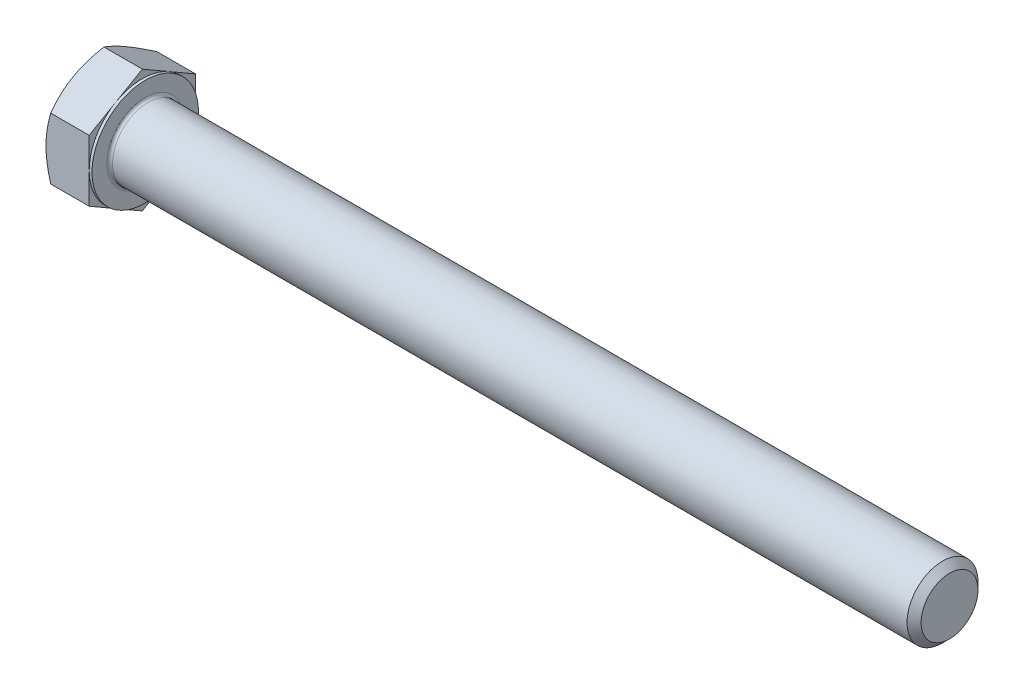
ISO-10303-21;
HEADER;
FILE_DESCRIPTION(('STEP AP214'),'2;1');
FILE_NAME('part.step','',(''),(''),'','','');
FILE_SCHEMA(('AUTOMOTIVE_DESIGN { 1 0 10303 214 1 1 1 1 }'));
ENDSEC;
DATA;
#1=APPLICATION_CONTEXT('core data for automotive mechanical design processes');
#2=APPLICATION_PROTOCOL_DEFINITION('international standard','automotive_design',2000,#1);
#3=PRODUCT_CONTEXT('',#1,'mechanical');
#4=PRODUCT('Part','Part','',(#3));
#5=PRODUCT_RELATED_PRODUCT_CATEGORY('part','',(#4));
#6=PRODUCT_DEFINITION_FORMATION('','',#4);
#7=PRODUCT_DEFINITION_CONTEXT('part definition',#1,'design');
#8=PRODUCT_DEFINITION('design','',#6,#7);
#9=PRODUCT_DEFINITION_SHAPE('','',#8);
#10=(LENGTH_UNIT() NAMED_UNIT(*) SI_UNIT(.MILLI.,.METRE.));
#11=(NAMED_UNIT(*) PLANE_ANGLE_UNIT() SI_UNIT($,.RADIAN.));
#12=(NAMED_UNIT(*) SI_UNIT($,.STERADIAN.) SOLID_ANGLE_UNIT());
#13=UNCERTAINTY_MEASURE_WITH_UNIT(LENGTH_MEASURE(1.E-05),#10,'distance_accuracy_value','');
#14=(GEOMETRIC_REPRESENTATION_CONTEXT(3) GLOBAL_UNCERTAINTY_ASSIGNED_CONTEXT((#13)) GLOBAL_UNIT_ASSIGNED_CONTEXT((#10,
#11,#12)) REPRESENTATION_CONTEXT('',''));
#15=CARTESIAN_POINT('',(0.,0.,0.));
#16=DIRECTION('',(0.,0.,1.));
#17=DIRECTION('',(1.,0.,0.));
#18=AXIS2_PLACEMENT_3D('',#15,#16,#17);
#19=CARTESIAN_POINT('',(0.,8.24155962262808,0.));
#20=DIRECTION('',(1.,0.,0.));
#21=DIRECTION('',(0.,0.,-1.));
#22=AXIS2_PLACEMENT_3D('',#19,#20,#21);
#23=PLANE('',#22);
#24=CARTESIAN_POINT('',(0.,0.,0.));
#25=DIRECTION('',(1.,0.,0.));
#26=DIRECTION('',(0.,0.,-1.));
#27=AXIS2_PLACEMENT_3D('',#24,#25,#26);
#28=CIRCLE('',#27,7.1374);
#29=CARTESIAN_POINT('',(0.,-6.18116971697105,-3.56870000000001));
#30=VERTEX_POINT('',#29);
#31=CARTESIAN_POINT('',(0.,0.,-7.1374));
#32=VERTEX_POINT('',#31);
#33=EDGE_CURVE('E114',#30,#32,#28,.T.);
#34=ORIENTED_EDGE('',*,*,#33,.F.);
#35=CARTESIAN_POINT('',(0.,0.,0.));
#36=DIRECTION('',(1.,0.,0.));
#37=DIRECTION('',(0.,0.,-1.));
#38=AXIS2_PLACEMENT_3D('',#35,#36,#37);
#39=CIRCLE('',#38,7.1374);
#40=CARTESIAN_POINT('',(0.,-6.18116971697106,3.56870000000001));
#41=VERTEX_POINT('',#40);
#42=EDGE_CURVE('E111',#41,#30,#39,.T.);
#43=ORIENTED_EDGE('',*,*,#42,.F.);
#44=CARTESIAN_POINT('',(0.,0.,0.));
#45=DIRECTION('',(1.,0.,0.));
#46=DIRECTION('',(0.,0.,-1.));
#47=AXIS2_PLACEMENT_3D('',#44,#45,#46);
#48=CIRCLE('',#47,7.1374);
#49=CARTESIAN_POINT('',(0.,0.,7.1374));
#50=VERTEX_POINT('',#49);
#51=EDGE_CURVE('E462',#50,#41,#48,.T.);
#52=ORIENTED_EDGE('',*,*,#51,.F.);
#53=CARTESIAN_POINT('',(0.,0.,0.));
#54=DIRECTION('',(1.,0.,0.));
#55=DIRECTION('',(0.,0.,-1.));
#56=AXIS2_PLACEMENT_3D('',#53,#54,#55);
#57=CIRCLE('',#56,7.1374);
#58=CARTESIAN_POINT('',(0.,6.18116971697105,3.56870000000001));
#59=VERTEX_POINT('',#58);
#60=EDGE_CURVE('E172',#59,#50,#57,.T.);
#61=ORIENTED_EDGE('',*,*,#60,.F.);
#62=CARTESIAN_POINT('',(0.,0.,0.));
#63=DIRECTION('',(1.,0.,0.));
#64=DIRECTION('',(0.,0.,-1.));
#65=AXIS2_PLACEMENT_3D('',#62,#63,#64);
#66=CIRCLE('',#65,7.1374);
#67=CARTESIAN_POINT('',(0.,6.18116971697105,-3.56870000000001));
#68=VERTEX_POINT('',#67);
#69=EDGE_CURVE('E460',#68,#59,#66,.T.);
#70=ORIENTED_EDGE('',*,*,#69,.F.);
#71=CARTESIAN_POINT('',(0.,0.,0.));
#72=DIRECTION('',(1.,0.,0.));
#73=DIRECTION('',(0.,0.,-1.));
#74=AXIS2_PLACEMENT_3D('',#71,#72,#73);
#75=CIRCLE('',#74,7.1374);
#76=EDGE_CURVE('E117',#32,#68,#75,.T.);
#77=ORIENTED_EDGE('',*,*,#76,.F.);
#78=EDGE_LOOP('',(#34,#43,#52,#61,#70,#77));
#79=FACE_BOUND('',#78,.T.);
#80=ADVANCED_FACE('F17',(#79),#23,.F.);
#81=CARTESIAN_POINT('',(0.641311776484754,0.,0.));
#82=DIRECTION('',(1.,0.,0.));
#83=DIRECTION('',(0.,0.,-1.));
#84=AXIS2_PLACEMENT_3D('',#81,#82,#83);
#85=CONICAL_SURFACE('',#84,8.24818458036387,1.0471975511966);
#86=ORIENTED_EDGE('',*,*,#42,.T.);
#87=CARTESIAN_POINT('',(0.,-6.18116971697106,-3.56870000000002));
#88=CARTESIAN_POINT('',(-2.91702878281906E-05,-6.26862170985652,-3.41722870509925));
#89=CARTESIAN_POINT('',(0.00371114889844038,-6.35606948988297,-3.26576470708432));
#90=CARTESIAN_POINT('',(0.0185139577467835,-6.53079334497843,-2.9631341127647));
#91=CARTESIAN_POINT('',(0.0295749978503088,-6.61806945060963,-2.81196746352471));
#92=CARTESIAN_POINT('',(0.0587296036169501,-6.7918862225359,-2.5109079833408));
#93=CARTESIAN_POINT('',(0.0767877659737066,-6.87842838481195,-2.3610125612818));
#94=CARTESIAN_POINT('',(0.119548178265526,-7.05110039256495,-2.06193587080869));
#95=CARTESIAN_POINT('',(0.144250603082628,-7.13723022712836,-1.91275462129736));
#96=CARTESIAN_POINT('',(0.227561148311189,-7.39464422393007,-1.46690050025742));
#97=CARTESIAN_POINT('',(0.295412992760169,-7.56518058886256,-1.17152285165624));
#98=CARTESIAN_POINT('',(0.451896700790797,-7.90478678087675,-0.583307672522674));
#99=CARTESIAN_POINT('',(0.540632343376944,-8.07384476218822,-0.290490659466179));
#100=CARTESIAN_POINT('',(0.637486855352638,-8.2415596226281,0.));
#101=B_SPLINE_CURVE_WITH_KNOTS('',3,(#87,#88,#89,#90,#91,#92,#93,#94,#95,#96,#97,#98,#99,#100),
.UNSPECIFIED.,.F.,.F.,(4,2,2,2,2,2,4),(0.,0.524658409500519,1.04921296370403,1.5711473776056,
2.09309553056225,3.13562382142666,4.18344647054619),.UNSPECIFIED.);
#102=CARTESIAN_POINT('',(0.637486855352637,-8.2415596226281,0.));
#103=VERTEX_POINT('',#102);
#104=EDGE_CURVE('E129',#30,#103,#101,.T.);
#105=ORIENTED_EDGE('',*,*,#104,.T.);
#106=CARTESIAN_POINT('',(0.637486855352637,-8.2415596226281,0.));
#107=CARTESIAN_POINT('',(0.540632343376944,-8.07384476218822,0.290490659466181));
#108=CARTESIAN_POINT('',(0.451896700790797,-7.90478678087675,0.583307672522676));
#109=CARTESIAN_POINT('',(0.295412992760169,-7.56518058886257,1.17152285165624));
#110=CARTESIAN_POINT('',(0.227561148311189,-7.39464422393008,1.46690050025742));
#111=CARTESIAN_POINT('',(0.14425060308263,-7.13723022712836,1.91275462129736));
#112=CARTESIAN_POINT('',(0.119548178265528,-7.05110039256495,2.06193587080869));
#113=CARTESIAN_POINT('',(0.0767877659737086,-6.87842838481196,2.3610125612818));
#114=CARTESIAN_POINT('',(0.0587296036169518,-6.7918862225359,2.5109079833408));
#115=CARTESIAN_POINT('',(0.0295749978503104,-6.61806945060963,2.81196746352471));
#116=CARTESIAN_POINT('',(0.0185139577467855,-6.53079334497843,2.9631341127647));
#117=CARTESIAN_POINT('',(0.00371114889844278,-6.35606948988298,3.26576470708432));
#118=CARTESIAN_POINT('',(-2.91702878256121E-05,-6.26862170985652,3.41722870509925));
#119=CARTESIAN_POINT('',(0.,-6.18116971697107,3.56870000000002));
#120=B_SPLINE_CURVE_WITH_KNOTS('',3,(#106,#107,#108,#109,#110,#111,#112,#113,#114,#115,#116,
#117,#118,#119),.UNSPECIFIED.,.F.,.F.,(4,2,2,2,2,2,4),(0.,1.04782264911953,2.09035093998394,
2.61229909294058,3.13423350684215,3.65878806104566,4.18344647054618),.UNSPECIFIED.);
#121=EDGE_CURVE('E135',#103,#41,#120,.T.);
#122=ORIENTED_EDGE('',*,*,#121,.T.);
#123=EDGE_LOOP('',(#86,#105,#122));
#124=FACE_BOUND('',#123,.T.);
#125=ADVANCED_FACE('F133',(#124),#85,.T.);
#126=CARTESIAN_POINT('',(0.641311776484743,0.,0.));
#127=DIRECTION('',(1.,0.,0.));
#128=DIRECTION('',(0.,0.,-1.));
#129=AXIS2_PLACEMENT_3D('',#126,#127,#128);
#130=CONICAL_SURFACE('',#129,8.24818458036385,1.0471975511966);
#131=ORIENTED_EDGE('',*,*,#33,.T.);
#132=CARTESIAN_POINT('',(0.,0.,-7.1374));
#133=CARTESIAN_POINT('',(-2.91702878363875E-05,-0.174903985770917,-7.1374));
#134=CARTESIAN_POINT('',(0.0037111488984321,-0.349799545823828,-7.1374));
#135=CARTESIAN_POINT('',(0.0185139577467752,-0.699247256014727,-7.1374));
#136=CARTESIAN_POINT('',(0.0295749978503004,-0.873799467277128,-7.1374));
#137=CARTESIAN_POINT('',(0.0587296036169417,-1.22143301112966,-7.1374));
#138=CARTESIAN_POINT('',(0.0767877659736981,-1.39451733568178,-7.1374));
#139=CARTESIAN_POINT('',(0.119548178265518,-1.73986135118776,-7.1374));
#140=CARTESIAN_POINT('',(0.144250603082619,-1.91212102031459,-7.1374));
#141=CARTESIAN_POINT('',(0.227561148311179,-2.42694901391801,-7.1374));
#142=CARTESIAN_POINT('',(0.295412992760159,-2.76802174378299,-7.1374));
#143=CARTESIAN_POINT('',(0.451896700790786,-3.44723412781136,-7.1374));
#144=CARTESIAN_POINT('',(0.540632343376933,-3.7853500904343,-7.1374));
#145=CARTESIAN_POINT('',(0.637486855352627,-4.12077981131404,-7.1374));
#146=B_SPLINE_CURVE_WITH_KNOTS('',3,(#132,#133,#134,#135,#136,#137,#138,#139,#140,#141,#142,
#143,#144,#145),.UNSPECIFIED.,.F.,.F.,(4,2,2,2,2,2,4),(0.,0.524658409500517,1.04921296370403,
1.5711473776056,2.09309553056224,3.13562382142665,4.18344647054617),.UNSPECIFIED.);
#147=CARTESIAN_POINT('',(0.637486855352626,-4.12077981131404,-7.1374));
#148=VERTEX_POINT('',#147);
#149=EDGE_CURVE('E125',#32,#148,#146,.T.);
#150=ORIENTED_EDGE('',*,*,#149,.T.);
#151=CARTESIAN_POINT('',(0.637486855352626,-4.12077981131404,-7.1374));
#152=CARTESIAN_POINT('',(0.540632343376933,-4.28849467175391,-6.84690934053382));
#153=CARTESIAN_POINT('',(0.451896700790788,-4.45755265306538,-6.55409232747733));
#154=CARTESIAN_POINT('',(0.295412992760162,-4.79715884507957,-5.96587714834377));
#155=CARTESIAN_POINT('',(0.227561148311183,-4.96769521001206,-5.6704994997426));
#156=CARTESIAN_POINT('',(0.144250603082625,-5.22510920681377,-5.22464537870266));
#157=CARTESIAN_POINT('',(0.119548178265524,-5.31123904137718,-5.07546412919133));
#158=CARTESIAN_POINT('',(0.076787765973705,-5.48391104913017,-4.77638743871822));
#159=CARTESIAN_POINT('',(0.0587296036169484,-5.57045321140623,-4.62649201665922));
#160=CARTESIAN_POINT('',(0.0295749978503076,-5.7442699833325,-4.32543253647532));
#161=CARTESIAN_POINT('',(0.0185139577467831,-5.8315460889637,-4.17426588723533));
#162=CARTESIAN_POINT('',(0.00371114889844091,-6.00626994405915,-3.87163529291571));
#163=CARTESIAN_POINT('',(-2.91702878274496E-05,-6.0937177240856,-3.72017129490078));
#164=CARTESIAN_POINT('',(0.,-6.18116971697106,-3.56870000000002));
#165=B_SPLINE_CURVE_WITH_KNOTS('',3,(#151,#152,#153,#154,#155,#156,#157,#158,#159,#160,#161,
#162,#163,#164),.UNSPECIFIED.,.F.,.F.,(4,2,2,2,2,2,4),(0.,1.04782264911952,2.09035093998392,
2.61229909294056,3.13423350684212,3.65878806104563,4.18344647054614),.UNSPECIFIED.);
#166=EDGE_CURVE('E123',#148,#30,#165,.T.);
#167=ORIENTED_EDGE('',*,*,#166,.T.);
#168=EDGE_LOOP('',(#131,#150,#167));
#169=FACE_BOUND('',#168,.T.);
#170=ADVANCED_FACE('F124',(#169),#130,.T.);
#171=CARTESIAN_POINT('',(0.641311776484739,0.,0.));
#172=DIRECTION('',(1.,0.,0.));
#173=DIRECTION('',(0.,0.,-1.));
#174=AXIS2_PLACEMENT_3D('',#171,#172,#173);
#175=CONICAL_SURFACE('',#174,8.24818458036384,1.0471975511966);
#176=CARTESIAN_POINT('',(0.637486855352624,4.12077981131404,-7.1374));
#177=CARTESIAN_POINT('',(0.540632343376931,3.78535009043429,-7.1374));
#178=CARTESIAN_POINT('',(0.451896700790785,3.44723412781136,-7.1374));
#179=CARTESIAN_POINT('',(0.295412992760157,2.76802174378299,-7.1374));
#180=CARTESIAN_POINT('',(0.227561148311177,2.42694901391801,-7.1374));
#181=CARTESIAN_POINT('',(0.144250603082619,1.91212102031458,-7.1374));
#182=CARTESIAN_POINT('',(0.119548178265517,1.73986135118776,-7.1374));
#183=CARTESIAN_POINT('',(0.076787765973698,1.39451733568178,-7.1374));
#184=CARTESIAN_POINT('',(0.0587296036169412,1.22143301112966,-7.1374));
#185=CARTESIAN_POINT('',(0.0295749978502998,0.873799467277126,-7.1374));
#186=CARTESIAN_POINT('',(0.018513957746775,0.699247256014726,-7.1374));
#187=CARTESIAN_POINT('',(0.0037111488984325,0.349799545823827,-7.1374));
#188=CARTESIAN_POINT('',(-2.91702878357943E-05,0.174903985770916,-7.1374));
#189=CARTESIAN_POINT('',(0.,0.,-7.1374));
#190=B_SPLINE_CURVE_WITH_KNOTS('',3,(#176,#177,#178,#179,#180,#181,#182,#183,#184,#185,#186,
#187,#188,#189),.UNSPECIFIED.,.F.,.F.,(4,2,2,2,2,2,4),(0.,1.04782264911952,2.09035093998393,
2.61229909294057,3.13423350684214,3.65878806104565,4.18344647054616),.UNSPECIFIED.);
#191=CARTESIAN_POINT('',(0.637486855352624,4.12077981131404,-7.1374));
#192=VERTEX_POINT('',#191);
#193=EDGE_CURVE('E143',#192,#32,#190,.T.);
#194=ORIENTED_EDGE('',*,*,#193,.T.);
#195=ORIENTED_EDGE('',*,*,#76,.T.);
#196=CARTESIAN_POINT('',(0.,6.18116971697105,-3.56870000000001));
#197=CARTESIAN_POINT('',(-2.9170287832926E-05,6.0937177240856,-3.72017129490077));
#198=CARTESIAN_POINT('',(0.00371114889843545,6.00626994405914,-3.8716352929157));
#199=CARTESIAN_POINT('',(0.018513957746778,5.83154608896369,-4.17426588723532));
#200=CARTESIAN_POINT('',(0.0295749978503029,5.74426998333249,-4.32543253647531));
#201=CARTESIAN_POINT('',(0.0587296036169437,5.57045321140622,-4.62649201665922));
#202=CARTESIAN_POINT('',(0.0767877659737001,5.48391104913017,-4.77638743871822));
#203=CARTESIAN_POINT('',(0.119548178265519,5.31123904137718,-5.07546412919132));
#204=CARTESIAN_POINT('',(0.144250603082621,5.22510920681376,-5.22464537870265));
#205=CARTESIAN_POINT('',(0.22756114831118,4.96769521001205,-5.67049949974259));
#206=CARTESIAN_POINT('',(0.295412992760159,4.79715884507956,-5.96587714834377));
#207=CARTESIAN_POINT('',(0.451896700790785,4.45755265306538,-6.55409232747733));
#208=CARTESIAN_POINT('',(0.540632343376931,4.28849467175391,-6.84690934053382));
#209=CARTESIAN_POINT('',(0.637486855352624,4.12077981131404,-7.1374));
#210=B_SPLINE_CURVE_WITH_KNOTS('',3,(#196,#197,#198,#199,#200,#201,#202,#203,#204,#205,#206,
#207,#208,#209),.UNSPECIFIED.,.F.,.F.,(4,2,2,2,2,2,4),(0.,0.524658409500515,1.04921296370402,
1.57114737760559,2.09309553056223,3.13562382142663,4.18344647054615),.UNSPECIFIED.);
#211=EDGE_CURVE('E249',#68,#192,#210,.T.);
#212=ORIENTED_EDGE('',*,*,#211,.T.);
#213=EDGE_LOOP('',(#194,#195,#212));
#214=FACE_BOUND('',#213,.T.);
#215=ADVANCED_FACE('F239',(#214),#175,.T.);
#216=CARTESIAN_POINT('',(0.641311776484745,0.,0.));
#217=DIRECTION('',(1.,0.,0.));
#218=DIRECTION('',(0.,0.,-1.));
#219=AXIS2_PLACEMENT_3D('',#216,#217,#218);
#220=CONICAL_SURFACE('',#219,8.24818458036385,1.0471975511966);
#221=CARTESIAN_POINT('',(0.637486855352629,8.24155962262808,0.));
#222=CARTESIAN_POINT('',(0.540632343376936,8.07384476218821,-0.290490659466181));
#223=CARTESIAN_POINT('',(0.45189670079079,7.90478678087674,-0.583307672522675));
#224=CARTESIAN_POINT('',(0.295412992760162,7.56518058886255,-1.17152285165624));
#225=CARTESIAN_POINT('',(0.227561148311182,7.39464422393006,-1.46690050025742));
#226=CARTESIAN_POINT('',(0.144250603082622,7.13723022712835,-1.91275462129736));
#227=CARTESIAN_POINT('',(0.119548178265521,7.05110039256494,-2.06193587080869));
#228=CARTESIAN_POINT('',(0.076787765973701,6.87842838481194,-2.3610125612818));
#229=CARTESIAN_POINT('',(0.0587296036169442,6.79188622253589,-2.5109079833408));
#230=CARTESIAN_POINT('',(0.0295749978503029,6.61806945060962,-2.81196746352471));
#231=CARTESIAN_POINT('',(0.018513957746778,6.53079334497842,-2.96313411276469));
#232=CARTESIAN_POINT('',(0.00371114889843529,6.35606948988297,-3.26576470708432));
#233=CARTESIAN_POINT('',(-2.91702878331806E-05,6.26862170985651,-3.41722870509924));
#234=CARTESIAN_POINT('',(0.,6.18116971697105,-3.56870000000001));
#235=B_SPLINE_CURVE_WITH_KNOTS('',3,(#221,#222,#223,#224,#225,#226,#227,#228,#229,#230,#231,
#232,#233,#234),.UNSPECIFIED.,.F.,.F.,(4,2,2,2,2,2,4),(0.,1.04782264911952,2.09035093998393,
2.61229909294058,3.13423350684215,3.65878806104566,4.18344647054617),.UNSPECIFIED.);
#236=CARTESIAN_POINT('',(0.637486855352629,8.24155962262808,0.));
#237=VERTEX_POINT('',#236);
#238=EDGE_CURVE('E244',#237,#68,#235,.T.);
#239=ORIENTED_EDGE('',*,*,#238,.T.);
#240=ORIENTED_EDGE('',*,*,#69,.T.);
#241=CARTESIAN_POINT('',(0.,6.18116971697105,3.56870000000001));
#242=CARTESIAN_POINT('',(-2.9170287834756E-05,6.26862170985651,3.41722870509925));
#243=CARTESIAN_POINT('',(0.00371114889843365,6.35606948988296,3.26576470708432));
#244=CARTESIAN_POINT('',(0.018513957746776,6.53079334497841,2.9631341127647));
#245=CARTESIAN_POINT('',(0.0295749978503007,6.61806945060961,2.81196746352471));
#246=CARTESIAN_POINT('',(0.0587296036169419,6.79188622253588,2.5109079833408));
#247=CARTESIAN_POINT('',(0.0767877659736988,6.87842838481194,2.3610125612818));
#248=CARTESIAN_POINT('',(0.119548178265519,7.05110039256493,2.06193587080869));
#249=CARTESIAN_POINT('',(0.14425060308262,7.13723022712835,1.91275462129736));
#250=CARTESIAN_POINT('',(0.22756114831118,7.39464422393006,1.46690050025742));
#251=CARTESIAN_POINT('',(0.295412992760161,7.56518058886255,1.17152285165624));
#252=CARTESIAN_POINT('',(0.451896700790789,7.90478678087674,0.583307672522675));
#253=CARTESIAN_POINT('',(0.540632343376935,8.07384476218821,0.29049065946618));
#254=CARTESIAN_POINT('',(0.637486855352629,8.24155962262808,0.));
#255=B_SPLINE_CURVE_WITH_KNOTS('',3,(#241,#242,#243,#244,#245,#246,#247,#248,#249,#250,#251,
#252,#253,#254),.UNSPECIFIED.,.F.,.F.,(4,2,2,2,2,2,4),(0.,0.524658409500518,1.04921296370403,
1.5711473776056,2.09309553056224,3.13562382142665,4.18344647054618),.UNSPECIFIED.);
#256=EDGE_CURVE('E231',#59,#237,#255,.T.);
#257=ORIENTED_EDGE('',*,*,#256,.T.);
#258=EDGE_LOOP('',(#239,#240,#257));
#259=FACE_BOUND('',#258,.T.);
#260=ADVANCED_FACE('F236',(#259),#220,.T.);
#261=CARTESIAN_POINT('',(0.641311776484745,0.,0.));
#262=DIRECTION('',(1.,0.,0.));
#263=DIRECTION('',(0.,0.,-1.));
#264=AXIS2_PLACEMENT_3D('',#261,#262,#263);
#265=CONICAL_SURFACE('',#264,8.24818458036385,1.0471975511966);
#266=ORIENTED_EDGE('',*,*,#51,.T.);
#267=CARTESIAN_POINT('',(0.,-6.18116971697107,3.56870000000002));
#268=CARTESIAN_POINT('',(-2.9170287825595E-05,-6.09371772408561,3.72017129490078));
#269=CARTESIAN_POINT('',(0.00371114889844298,-6.00626994405915,3.87163529291571));
#270=CARTESIAN_POINT('',(0.0185139577467859,-5.8315460889637,4.17426588723533));
#271=CARTESIAN_POINT('',(0.0295749978503109,-5.7442699833325,4.32543253647531));
#272=CARTESIAN_POINT('',(0.0587296036169516,-5.57045321140624,4.62649201665922));
#273=CARTESIAN_POINT('',(0.0767877659737078,-5.48391104913018,4.77638743871822));
#274=CARTESIAN_POINT('',(0.119548178265527,-5.31123904137719,5.07546412919133));
#275=CARTESIAN_POINT('',(0.144250603082628,-5.22510920681378,5.22464537870266));
#276=CARTESIAN_POINT('',(0.227561148311187,-4.96769521001206,5.6704994997426));
#277=CARTESIAN_POINT('',(0.295412992760166,-4.79715884507958,5.96587714834377));
#278=CARTESIAN_POINT('',(0.451896700790791,-4.45755265306539,6.55409232747733));
#279=CARTESIAN_POINT('',(0.540632343376936,-4.28849467175392,6.84690934053382));
#280=CARTESIAN_POINT('',(0.637486855352629,-4.12077981131405,7.1374));
#281=B_SPLINE_CURVE_WITH_KNOTS('',3,(#267,#268,#269,#270,#271,#272,#273,#274,#275,#276,#277,
#278,#279,#280),.UNSPECIFIED.,.F.,.F.,(4,2,2,2,2,2,4),(0.,0.524658409500513,1.04921296370402,
1.57114737760559,2.09309553056223,3.13562382142663,4.18344647054615),.UNSPECIFIED.);
#282=CARTESIAN_POINT('',(0.637486855352629,-4.12077981131405,7.1374));
#283=VERTEX_POINT('',#282);
#284=EDGE_CURVE('E130',#41,#283,#281,.T.);
#285=ORIENTED_EDGE('',*,*,#284,.T.);
#286=CARTESIAN_POINT('',(0.637486855352629,-4.12077981131405,7.1374));
#287=CARTESIAN_POINT('',(0.540632343376935,-3.78535009043431,7.1374));
#288=CARTESIAN_POINT('',(0.451896700790788,-3.44723412781137,7.1374));
#289=CARTESIAN_POINT('',(0.29541299276016,-2.768021743783,7.1374));
#290=CARTESIAN_POINT('',(0.22756114831118,-2.42694901391802,7.1374));
#291=CARTESIAN_POINT('',(0.14425060308262,-1.91212102031459,7.1374));
#292=CARTESIAN_POINT('',(0.119548178265519,-1.73986135118776,7.1374));
#293=CARTESIAN_POINT('',(0.0767877659736989,-1.39451733568178,7.1374));
#294=CARTESIAN_POINT('',(0.0587296036169421,-1.22143301112967,7.1374));
#295=CARTESIAN_POINT('',(0.0295749978503008,-0.87379946727713,7.1374));
#296=CARTESIAN_POINT('',(0.018513957746776,-0.699247256014728,7.1374));
#297=CARTESIAN_POINT('',(0.00371114889843334,-0.349799545823828,7.1374));
#298=CARTESIAN_POINT('',(-2.91702878350887E-05,-0.174903985770916,7.1374));
#299=CARTESIAN_POINT('',(0.,0.,7.1374));
#300=B_SPLINE_CURVE_WITH_KNOTS('',3,(#286,#287,#288,#289,#290,#291,#292,#293,#294,#295,#296,
#297,#298,#299),.UNSPECIFIED.,.F.,.F.,(4,2,2,2,2,2,4),(0.,1.04782264911953,2.09035093998394,
2.61229909294058,3.13423350684215,3.65878806104566,4.18344647054618),.UNSPECIFIED.);
#301=EDGE_CURVE('E209',#283,#50,#300,.T.);
#302=ORIENTED_EDGE('',*,*,#301,.T.);
#303=EDGE_LOOP('',(#266,#285,#302));
#304=FACE_BOUND('',#303,.T.);
#305=ADVANCED_FACE('F187',(#304),#265,.T.);
#306=CARTESIAN_POINT('',(0.641311776484738,0.,0.));
#307=DIRECTION('',(1.,0.,0.));
#308=DIRECTION('',(0.,0.,-1.));
#309=AXIS2_PLACEMENT_3D('',#306,#307,#308);
#310=CONICAL_SURFACE('',#309,8.24818458036384,1.0471975511966);
#311=CARTESIAN_POINT('',(0.637486855352622,4.12077981131403,7.1374));
#312=CARTESIAN_POINT('',(0.540632343376929,4.2884946717539,6.84690934053382));
#313=CARTESIAN_POINT('',(0.451896700790783,4.45755265306537,6.55409232747733));
#314=CARTESIAN_POINT('',(0.295412992760157,4.79715884507955,5.96587714834377));
#315=CARTESIAN_POINT('',(0.227561148311178,4.96769521001204,5.67049949974259));
#316=CARTESIAN_POINT('',(0.144250603082619,5.22510920681376,5.22464537870266));
#317=CARTESIAN_POINT('',(0.119548178265518,5.31123904137717,5.07546412919132));
#318=CARTESIAN_POINT('',(0.0767877659736985,5.48391104913016,4.77638743871822));
#319=CARTESIAN_POINT('',(0.0587296036169418,5.57045321140622,4.62649201665922));
#320=CARTESIAN_POINT('',(0.0295749978503007,5.74426998333248,4.32543253647531));
#321=CARTESIAN_POINT('',(0.0185139577467759,5.83154608896368,4.17426588723532));
#322=CARTESIAN_POINT('',(0.00371114889843337,6.00626994405913,3.8716352929157));
#323=CARTESIAN_POINT('',(-2.91702878350612E-05,6.09371772408559,3.72017129490078));
#324=CARTESIAN_POINT('',(0.,6.18116971697105,3.56870000000001));
#325=B_SPLINE_CURVE_WITH_KNOTS('',3,(#311,#312,#313,#314,#315,#316,#317,#318,#319,#320,#321,
#322,#323,#324),.UNSPECIFIED.,.F.,.F.,(4,2,2,2,2,2,4),(0.,1.04782264911952,2.09035093998392,
2.61229909294056,3.13423350684213,3.65878806104564,4.18344647054615),.UNSPECIFIED.);
#326=CARTESIAN_POINT('',(0.637486855352622,4.12077981131403,7.1374));
#327=VERTEX_POINT('',#326);
#328=EDGE_CURVE('E193',#327,#59,#325,.T.);
#329=ORIENTED_EDGE('',*,*,#328,.T.);
#330=ORIENTED_EDGE('',*,*,#60,.T.);
#331=CARTESIAN_POINT('',(0.,0.,7.1374));
#332=CARTESIAN_POINT('',(-2.91702878350349E-05,0.174903985770917,7.1374));
#333=CARTESIAN_POINT('',(0.00371114889843339,0.349799545823827,7.1374));
#334=CARTESIAN_POINT('',(0.0185139577467758,0.699247256014725,7.1374));
#335=CARTESIAN_POINT('',(0.0295749978503005,0.873799467277125,7.1374));
#336=CARTESIAN_POINT('',(0.0587296036169414,1.22143301112966,7.1374));
#337=CARTESIAN_POINT('',(0.076787765973698,1.39451733568177,7.1374));
#338=CARTESIAN_POINT('',(0.119548178265517,1.73986135118775,7.1374));
#339=CARTESIAN_POINT('',(0.144250603082619,1.91212102031458,7.1374));
#340=CARTESIAN_POINT('',(0.227561148311177,2.426949013918,7.1374));
#341=CARTESIAN_POINT('',(0.295412992760157,2.76802174378298,7.1374));
#342=CARTESIAN_POINT('',(0.451896700790783,3.44723412781135,7.1374));
#343=CARTESIAN_POINT('',(0.540632343376929,3.78535009043429,7.1374));
#344=CARTESIAN_POINT('',(0.637486855352622,4.12077981131403,7.1374));
#345=B_SPLINE_CURVE_WITH_KNOTS('',3,(#331,#332,#333,#334,#335,#336,#337,#338,#339,#340,#341,
#342,#343,#344),.UNSPECIFIED.,.F.,.F.,(4,2,2,2,2,2,4),(0.,0.524658409500515,1.04921296370402,
1.57114737760559,2.09309553056223,3.13562382142663,4.18344647054615),.UNSPECIFIED.);
#346=EDGE_CURVE('E201',#50,#327,#345,.T.);
#347=ORIENTED_EDGE('',*,*,#346,.T.);
#348=EDGE_LOOP('',(#329,#330,#347));
#349=FACE_BOUND('',#348,.T.);
#350=ADVANCED_FACE('F182',(#349),#310,.T.);
#351=CARTESIAN_POINT('',(6.1722,-8.2415596226281,0.));
#352=DIRECTION('',(0.,0.866025403784438,-0.500000000000001));
#353=DIRECTION('',(0.,0.500000000000001,0.866025403784438));
#354=AXIS2_PLACEMENT_3D('',#351,#352,#353);
#355=PLANE('',#354);
#356=DIRECTION('',(-1.,0.,0.));
#357=VECTOR('',#356,1.);
#358=CARTESIAN_POINT('',(6.1722,-4.12077981131405,7.1374));
#359=LINE('',#358,#357);
#360=CARTESIAN_POINT('',(5.7912,-4.12077981131405,7.1374));
#361=VERTEX_POINT('',#360);
#362=EDGE_CURVE('E386',#361,#283,#359,.T.);
#363=ORIENTED_EDGE('',*,*,#362,.T.);
#364=ORIENTED_EDGE('',*,*,#284,.F.);
#365=ORIENTED_EDGE('',*,*,#121,.F.);
#366=DIRECTION('',(1.,0.,0.));
#367=VECTOR('',#366,1.);
#368=CARTESIAN_POINT('',(6.1722,-8.2415596226281,0.));
#369=LINE('',#368,#367);
#370=CARTESIAN_POINT('',(5.7912,-8.2415596226281,0.));
#371=VERTEX_POINT('',#370);
#372=EDGE_CURVE('E141',#103,#371,#369,.T.);
#373=ORIENTED_EDGE('',*,*,#372,.T.);
#374=DIRECTION('',(0.,-0.500000000000005,-0.866025403784436));
#375=VECTOR('',#374,1.);
#376=CARTESIAN_POINT('',(5.7912,-6.18116971697105,3.5687));
#377=LINE('',#376,#375);
#378=CARTESIAN_POINT('',(5.7912,-6.18116971697105,3.5687));
#379=VERTEX_POINT('',#378);
#380=EDGE_CURVE('E366',#379,#371,#377,.T.);
#381=ORIENTED_EDGE('',*,*,#380,.F.);
#382=DIRECTION('',(0.,-0.499999999999996,-0.866025403784441));
#383=VECTOR('',#382,1.);
#384=CARTESIAN_POINT('',(5.7912,-4.12077981131405,7.1374));
#385=LINE('',#384,#383);
#386=EDGE_CURVE('E371',#361,#379,#385,.T.);
#387=ORIENTED_EDGE('',*,*,#386,.F.);
#388=EDGE_LOOP('',(#363,#364,#365,#373,#381,#387));
#389=FACE_BOUND('',#388,.T.);
#390=ADVANCED_FACE('F178',(#389),#355,.F.);
#391=CARTESIAN_POINT('',(6.1722,-4.12077981131404,-7.1374));
#392=DIRECTION('',(0.,0.866025403784438,0.500000000000001));
#393=DIRECTION('',(0.,-0.500000000000001,0.866025403784438));
#394=AXIS2_PLACEMENT_3D('',#391,#392,#393);
#395=PLANE('',#394);
#396=ORIENTED_EDGE('',*,*,#372,.F.);
#397=ORIENTED_EDGE('',*,*,#104,.F.);
#398=ORIENTED_EDGE('',*,*,#166,.F.);
#399=DIRECTION('',(1.,0.,0.));
#400=VECTOR('',#399,1.);
#401=CARTESIAN_POINT('',(6.1722,-4.12077981131404,-7.1374));
#402=LINE('',#401,#400);
#403=CARTESIAN_POINT('',(5.7912,-4.12077981131404,-7.1374));
#404=VERTEX_POINT('',#403);
#405=EDGE_CURVE('E250',#148,#404,#402,.T.);
#406=ORIENTED_EDGE('',*,*,#405,.T.);
#407=DIRECTION('',(0.,0.499999999999998,-0.866025403784439));
#408=VECTOR('',#407,1.);
#409=CARTESIAN_POINT('',(5.7912,-6.18116971697105,-3.56870000000001));
#410=LINE('',#409,#408);
#411=CARTESIAN_POINT('',(5.7912,-6.18116971697104,-3.56870000000001));
#412=VERTEX_POINT('',#411);
#413=EDGE_CURVE('E356',#412,#404,#410,.T.);
#414=ORIENTED_EDGE('',*,*,#413,.F.);
#415=DIRECTION('',(0.,0.500000000000005,-0.866025403784436));
#416=VECTOR('',#415,1.);
#417=CARTESIAN_POINT('',(5.7912,-8.2415596226281,0.));
#418=LINE('',#417,#416);
#419=EDGE_CURVE('E361',#371,#412,#418,.T.);
#420=ORIENTED_EDGE('',*,*,#419,.F.);
#421=EDGE_LOOP('',(#396,#397,#398,#406,#414,#420));
#422=FACE_BOUND('',#421,.T.);
#423=ADVANCED_FACE('F139',(#422),#395,.F.);
#424=CARTESIAN_POINT('',(6.1722,4.12077981131404,-7.1374));
#425=DIRECTION('',(0.,0.,1.));
#426=DIRECTION('',(0.,-1.,0.));
#427=AXIS2_PLACEMENT_3D('',#424,#425,#426);
#428=PLANE('',#427);
#429=ORIENTED_EDGE('',*,*,#405,.F.);
#430=ORIENTED_EDGE('',*,*,#149,.F.);
#431=ORIENTED_EDGE('',*,*,#193,.F.);
#432=DIRECTION('',(1.,0.,0.));
#433=VECTOR('',#432,1.);
#434=CARTESIAN_POINT('',(6.1722,4.12077981131404,-7.1374));
#435=LINE('',#434,#433);
#436=CARTESIAN_POINT('',(5.7912,4.12077981131404,-7.1374));
#437=VERTEX_POINT('',#436);
#438=EDGE_CURVE('E394',#192,#437,#435,.T.);
#439=ORIENTED_EDGE('',*,*,#438,.T.);
#440=DIRECTION('',(0.,1.,0.));
#441=VECTOR('',#440,1.);
#442=CARTESIAN_POINT('',(5.7912,7.1374,-7.1374));
#443=LINE('',#442,#441);
#444=CARTESIAN_POINT('',(5.7912,0.,-7.1374));
#445=VERTEX_POINT('',#444);
#446=EDGE_CURVE('E341',#445,#437,#443,.T.);
#447=ORIENTED_EDGE('',*,*,#446,.F.);
#448=DIRECTION('',(0.,1.,0.));
#449=VECTOR('',#448,1.);
#450=CARTESIAN_POINT('',(5.7912,7.1374,-7.1374));
#451=LINE('',#450,#449);
#452=EDGE_CURVE('E351',#404,#445,#451,.T.);
#453=ORIENTED_EDGE('',*,*,#452,.F.);
#454=EDGE_LOOP('',(#429,#430,#431,#439,#447,#453));
#455=FACE_BOUND('',#454,.T.);
#456=ADVANCED_FACE('F257',(#455),#428,.F.);
#457=CARTESIAN_POINT('',(6.1722,4.12077981131404,-7.1374));
#458=DIRECTION('',(0.,-0.866025403784438,0.500000000000001));
#459=DIRECTION('',(0.,-0.500000000000001,-0.866025403784438));
#460=AXIS2_PLACEMENT_3D('',#457,#458,#459);
#461=PLANE('',#460);
#462=ORIENTED_EDGE('',*,*,#438,.F.);
#463=ORIENTED_EDGE('',*,*,#211,.F.);
#464=ORIENTED_EDGE('',*,*,#238,.F.);
#465=DIRECTION('',(1.,0.,0.));
#466=VECTOR('',#465,1.);
#467=CARTESIAN_POINT('',(6.1722,8.24155962262808,0.));
#468=LINE('',#467,#466);
#469=CARTESIAN_POINT('',(5.7912,8.24155962262808,0.));
#470=VERTEX_POINT('',#469);
#471=EDGE_CURVE('E235',#237,#470,#468,.T.);
#472=ORIENTED_EDGE('',*,*,#471,.T.);
#473=DIRECTION('',(0.,0.500000000000002,0.866025403784437));
#474=VECTOR('',#473,1.);
#475=CARTESIAN_POINT('',(5.7912,6.18116971697105,-3.56870000000001));
#476=LINE('',#475,#474);
#477=CARTESIAN_POINT('',(5.7912,6.18116971697105,-3.5687));
#478=VERTEX_POINT('',#477);
#479=EDGE_CURVE('E336',#478,#470,#476,.T.);
#480=ORIENTED_EDGE('',*,*,#479,.F.);
#481=DIRECTION('',(0.,0.5,0.866025403784439));
#482=VECTOR('',#481,1.);
#483=CARTESIAN_POINT('',(5.7912,4.12077981131404,-7.1374));
#484=LINE('',#483,#482);
#485=EDGE_CURVE('E346',#437,#478,#484,.T.);
#486=ORIENTED_EDGE('',*,*,#485,.F.);
#487=EDGE_LOOP('',(#462,#463,#464,#472,#480,#486));
#488=FACE_BOUND('',#487,.T.);
#489=ADVANCED_FACE('F227',(#488),#461,.F.);
#490=CARTESIAN_POINT('',(6.1722,8.24155962262808,0.));
#491=DIRECTION('',(0.,-0.866025403784438,-0.500000000000001));
#492=DIRECTION('',(0.,0.500000000000001,-0.866025403784438));
#493=AXIS2_PLACEMENT_3D('',#490,#491,#492);
#494=PLANE('',#493);
#495=ORIENTED_EDGE('',*,*,#471,.F.);
#496=ORIENTED_EDGE('',*,*,#256,.F.);
#497=ORIENTED_EDGE('',*,*,#328,.F.);
#498=DIRECTION('',(-1.,0.,0.));
#499=VECTOR('',#498,1.);
#500=CARTESIAN_POINT('',(6.1722,4.12077981131403,7.1374));
#501=LINE('',#500,#499);
#502=CARTESIAN_POINT('',(5.7912,4.12077981131403,7.1374));
#503=VERTEX_POINT('',#502);
#504=EDGE_CURVE('E208',#327,#503,#501,.F.);
#505=ORIENTED_EDGE('',*,*,#504,.T.);
#506=DIRECTION('',(0.,-0.500000000000001,0.866025403784438));
#507=VECTOR('',#506,1.);
#508=CARTESIAN_POINT('',(5.7912,6.18116971697105,3.56870000000001));
#509=LINE('',#508,#507);
#510=CARTESIAN_POINT('',(5.7912,6.18116971697104,3.56870000000001));
#511=VERTEX_POINT('',#510);
#512=EDGE_CURVE('E326',#511,#503,#509,.T.);
#513=ORIENTED_EDGE('',*,*,#512,.F.);
#514=DIRECTION('',(0.,-0.500000000000002,0.866025403784438));
#515=VECTOR('',#514,1.);
#516=CARTESIAN_POINT('',(5.7912,8.24155962262808,0.));
#517=LINE('',#516,#515);
#518=EDGE_CURVE('E331',#470,#511,#517,.T.);
#519=ORIENTED_EDGE('',*,*,#518,.F.);
#520=EDGE_LOOP('',(#495,#496,#497,#505,#513,#519));
#521=FACE_BOUND('',#520,.T.);
#522=ADVANCED_FACE('F220',(#521),#494,.F.);
#523=CARTESIAN_POINT('',(6.1722,4.12077981131403,7.1374));
#524=DIRECTION('',(0.,0.,-1.));
#525=DIRECTION('',(-1.,0.,0.));
#526=AXIS2_PLACEMENT_3D('',#523,#524,#525);
#527=PLANE('',#526);
#528=ORIENTED_EDGE('',*,*,#504,.F.);
#529=ORIENTED_EDGE('',*,*,#346,.F.);
#530=ORIENTED_EDGE('',*,*,#301,.F.);
#531=ORIENTED_EDGE('',*,*,#362,.F.);
#532=DIRECTION('',(0.,1.,0.));
#533=VECTOR('',#532,1.);
#534=CARTESIAN_POINT('',(5.7912,7.1374,7.1374));
#535=LINE('',#534,#533);
#536=CARTESIAN_POINT('',(5.7912,0.,7.1374));
#537=VERTEX_POINT('',#536);
#538=EDGE_CURVE('E376',#537,#361,#535,.F.);
#539=ORIENTED_EDGE('',*,*,#538,.F.);
#540=DIRECTION('',(0.,1.,0.));
#541=VECTOR('',#540,1.);
#542=CARTESIAN_POINT('',(5.7912,7.1374,7.1374));
#543=LINE('',#542,#541);
#544=EDGE_CURVE('E318',#503,#537,#543,.F.);
#545=ORIENTED_EDGE('',*,*,#544,.F.);
#546=EDGE_LOOP('',(#528,#529,#530,#531,#539,#545));
#547=FACE_BOUND('',#546,.T.);
#548=ADVANCED_FACE('F215',(#547),#527,.F.);
#549=CARTESIAN_POINT('',(5.7912,7.1374,0.));
#550=DIRECTION('',(1.,0.,0.));
#551=DIRECTION('',(0.,0.,-1.));
#552=AXIS2_PLACEMENT_3D('',#549,#550,#551);
#553=PLANE('',#552);
#554=ORIENTED_EDGE('',*,*,#386,.T.);
#555=CARTESIAN_POINT('',(5.7912,0.,0.));
#556=DIRECTION('',(-1.,0.,0.));
#557=DIRECTION('',(0.,0.,1.));
#558=AXIS2_PLACEMENT_3D('',#555,#556,#557);
#559=CIRCLE('',#558,7.1374);
#560=EDGE_CURVE('E210',#537,#379,#559,.F.);
#561=ORIENTED_EDGE('',*,*,#560,.F.);
#562=ORIENTED_EDGE('',*,*,#538,.T.);
#563=EDGE_LOOP('',(#554,#561,#562));
#564=FACE_BOUND('',#563,.T.);
#565=ADVANCED_FACE('F219',(#564),#553,.T.);
#566=CARTESIAN_POINT('',(5.7912,7.1374,0.));
#567=DIRECTION('',(1.,0.,0.));
#568=DIRECTION('',(0.,0.,-1.));
#569=AXIS2_PLACEMENT_3D('',#566,#567,#568);
#570=PLANE('',#569);
#571=ORIENTED_EDGE('',*,*,#419,.T.);
#572=CARTESIAN_POINT('',(5.7912,0.,0.));
#573=DIRECTION('',(-1.,0.,0.));
#574=DIRECTION('',(0.,0.,1.));
#575=AXIS2_PLACEMENT_3D('',#572,#573,#574);
#576=CIRCLE('',#575,7.1374);
#577=EDGE_CURVE('E420',#379,#412,#576,.F.);
#578=ORIENTED_EDGE('',*,*,#577,.F.);
#579=ORIENTED_EDGE('',*,*,#380,.T.);
#580=EDGE_LOOP('',(#571,#578,#579));
#581=FACE_BOUND('',#580,.T.);
#582=ADVANCED_FACE('F440',(#581),#570,.T.);
#583=CARTESIAN_POINT('',(5.7912,7.1374,0.));
#584=DIRECTION('',(1.,0.,0.));
#585=DIRECTION('',(0.,0.,-1.));
#586=AXIS2_PLACEMENT_3D('',#583,#584,#585);
#587=PLANE('',#586);
#588=ORIENTED_EDGE('',*,*,#452,.T.);
#589=CARTESIAN_POINT('',(5.7912,0.,0.));
#590=DIRECTION('',(-1.,0.,0.));
#591=DIRECTION('',(0.,0.,1.));
#592=AXIS2_PLACEMENT_3D('',#589,#590,#591);
#593=CIRCLE('',#592,7.1374);
#594=EDGE_CURVE('E418',#412,#445,#593,.F.);
#595=ORIENTED_EDGE('',*,*,#594,.F.);
#596=ORIENTED_EDGE('',*,*,#413,.T.);
#597=EDGE_LOOP('',(#588,#595,#596));
#598=FACE_BOUND('',#597,.T.);
#599=ADVANCED_FACE('F443',(#598),#587,.T.);
#600=CARTESIAN_POINT('',(5.7912,7.1374,0.));
#601=DIRECTION('',(1.,0.,0.));
#602=DIRECTION('',(0.,0.,-1.));
#603=AXIS2_PLACEMENT_3D('',#600,#601,#602);
#604=PLANE('',#603);
#605=CARTESIAN_POINT('',(5.7912,0.,0.));
#606=DIRECTION('',(-1.,0.,0.));
#607=DIRECTION('',(0.,0.,1.));
#608=AXIS2_PLACEMENT_3D('',#605,#606,#607);
#609=CIRCLE('',#608,7.1374);
#610=EDGE_CURVE('E415',#445,#478,#609,.F.);
#611=ORIENTED_EDGE('',*,*,#610,.F.);
#612=ORIENTED_EDGE('',*,*,#446,.T.);
#613=ORIENTED_EDGE('',*,*,#485,.T.);
#614=EDGE_LOOP('',(#611,#612,#613));
#615=FACE_BOUND('',#614,.T.);
#616=ADVANCED_FACE('F447',(#615),#604,.T.);
#617=CARTESIAN_POINT('',(5.7912,7.1374,0.));
#618=DIRECTION('',(1.,0.,0.));
#619=DIRECTION('',(0.,0.,-1.));
#620=AXIS2_PLACEMENT_3D('',#617,#618,#619);
#621=PLANE('',#620);
#622=ORIENTED_EDGE('',*,*,#518,.T.);
#623=CARTESIAN_POINT('',(5.7912,0.,0.));
#624=DIRECTION('',(-1.,0.,0.));
#625=DIRECTION('',(0.,0.,1.));
#626=AXIS2_PLACEMENT_3D('',#623,#624,#625);
#627=CIRCLE('',#626,7.1374);
#628=EDGE_CURVE('E412',#478,#511,#627,.F.);
#629=ORIENTED_EDGE('',*,*,#628,.F.);
#630=ORIENTED_EDGE('',*,*,#479,.T.);
#631=EDGE_LOOP('',(#622,#629,#630));
#632=FACE_BOUND('',#631,.T.);
#633=ADVANCED_FACE('F452',(#632),#621,.T.);
#634=CARTESIAN_POINT('',(5.7912,7.1374,0.));
#635=DIRECTION('',(1.,0.,0.));
#636=DIRECTION('',(0.,0.,-1.));
#637=AXIS2_PLACEMENT_3D('',#634,#635,#636);
#638=PLANE('',#637);
#639=ORIENTED_EDGE('',*,*,#544,.T.);
#640=CARTESIAN_POINT('',(5.7912,0.,0.));
#641=DIRECTION('',(-1.,0.,0.));
#642=DIRECTION('',(0.,0.,1.));
#643=AXIS2_PLACEMENT_3D('',#640,#641,#642);
#644=CIRCLE('',#643,7.1374);
#645=EDGE_CURVE('E409',#511,#537,#644,.F.);
#646=ORIENTED_EDGE('',*,*,#645,.F.);
#647=ORIENTED_EDGE('',*,*,#512,.T.);
#648=EDGE_LOOP('',(#639,#646,#647));
#649=FACE_BOUND('',#648,.T.);
#650=ADVANCED_FACE('F433',(#649),#638,.T.);
#651=CARTESIAN_POINT('',(0.,0.,0.));
#652=DIRECTION('',(-1.,0.,0.));
#653=DIRECTION('',(0.,0.,1.));
#654=AXIS2_PLACEMENT_3D('',#651,#652,#653);
#655=CYLINDRICAL_SURFACE('',#654,7.1374);
#656=ORIENTED_EDGE('',*,*,#594,.T.);
#657=ORIENTED_EDGE('',*,*,#610,.T.);
#658=ORIENTED_EDGE('',*,*,#628,.T.);
#659=ORIENTED_EDGE('',*,*,#645,.T.);
#660=ORIENTED_EDGE('',*,*,#560,.T.);
#661=ORIENTED_EDGE('',*,*,#577,.T.);
#662=EDGE_LOOP('',(#656,#657,#658,#659,#660,#661));
#663=FACE_BOUND('',#662,.T.);
#664=CARTESIAN_POINT('',(6.1722,0.,0.));
#665=DIRECTION('',(-1.,0.,0.));
#666=DIRECTION('',(0.,0.,1.));
#667=AXIS2_PLACEMENT_3D('',#664,#665,#666);
#668=CIRCLE('',#667,7.1374);
#669=CARTESIAN_POINT('',(6.1722,0.,7.1374));
#670=VERTEX_POINT('',#669);
#671=EDGE_CURVE('E406',#670,#670,#668,.F.);
#672=ORIENTED_EDGE('',*,*,#671,.F.);
#673=EDGE_LOOP('',(#672));
#674=FACE_BOUND('',#673,.T.);
#675=ADVANCED_FACE('F426',(#663,#674),#655,.T.);
#676=CARTESIAN_POINT('',(114.1222,0.,0.));
#677=DIRECTION('',(-1.,0.,0.));
#678=DIRECTION('',(0.,0.,1.));
#679=AXIS2_PLACEMENT_3D('',#676,#677,#678);
#680=PLANE('',#679);
#681=CARTESIAN_POINT('',(114.122199999997,0.,0.));
#682=DIRECTION('',(-1.,0.,0.));
#683=DIRECTION('',(0.,0.,1.));
#684=AXIS2_PLACEMENT_3D('',#681,#682,#683);
#685=CIRCLE('',#684,3.81635000002234);
#686=CARTESIAN_POINT('',(114.122199999997,0.,3.81635000002234));
#687=VERTEX_POINT('',#686);
#688=EDGE_CURVE('E403',#687,#687,#685,.T.);
#689=ORIENTED_EDGE('',*,*,#688,.F.);
#690=EDGE_LOOP('',(#689));
#691=FACE_BOUND('',#690,.T.);
#692=ADVANCED_FACE('F302',(#691),#680,.F.);
#693=CARTESIAN_POINT('',(6.1722,8.24155962262808,0.));
#694=DIRECTION('',(1.,0.,0.));
#695=DIRECTION('',(0.,0.,-1.));
#696=AXIS2_PLACEMENT_3D('',#693,#694,#695);
#697=PLANE('',#696);
#698=ORIENTED_EDGE('',*,*,#671,.T.);
#699=EDGE_LOOP('',(#698));
#700=FACE_BOUND('',#699,.T.);
#701=CARTESIAN_POINT('',(6.1722,0.,0.));
#702=DIRECTION('',(1.,0.,0.));
#703=DIRECTION('',(0.,0.,1.));
#704=AXIS2_PLACEMENT_3D('',#701,#702,#703);
#705=CIRCLE('',#704,5.1435);
#706=CARTESIAN_POINT('',(6.1722,0.,-5.1435));
#707=VERTEX_POINT('',#706);
#708=CARTESIAN_POINT('',(6.1722,0.,5.1435));
#709=VERTEX_POINT('',#708);
#710=EDGE_CURVE('E289',#707,#709,#705,.F.);
#711=ORIENTED_EDGE('',*,*,#710,.T.);
#712=CARTESIAN_POINT('',(6.1722,0.,0.));
#713=DIRECTION('',(1.,0.,0.));
#714=DIRECTION('',(0.,0.,-1.));
#715=AXIS2_PLACEMENT_3D('',#712,#713,#714);
#716=CIRCLE('',#715,5.1435);
#717=EDGE_CURVE('E36',#709,#707,#716,.F.);
#718=ORIENTED_EDGE('',*,*,#717,.T.);
#719=EDGE_LOOP('',(#711,#718));
#720=FACE_BOUND('',#719,.T.);
#721=ADVANCED_FACE('F293',(#700,#720),#697,.T.);
#722=CARTESIAN_POINT('',(113.176049999993,0.,0.));
#723=DIRECTION('',(-1.,0.,0.));
#724=DIRECTION('',(0.,0.,1.));
#725=AXIS2_PLACEMENT_3D('',#722,#723,#724);
#726=CONICAL_SURFACE('',#725,4.7624999999698,0.785398163367409);
#727=CARTESIAN_POINT('',(113.17605,0.,0.));
#728=DIRECTION('',(-1.,0.,0.));
#729=DIRECTION('',(0.,0.,1.));
#730=AXIS2_PLACEMENT_3D('',#727,#728,#729);
#731=CIRCLE('',#730,4.7625);
#732=CARTESIAN_POINT('',(113.17605,0.,4.7625));
#733=VERTEX_POINT('',#732);
#734=EDGE_CURVE('E28',#733,#733,#731,.T.);
#735=ORIENTED_EDGE('',*,*,#734,.F.);
#736=EDGE_LOOP('',(#735));
#737=FACE_BOUND('',#736,.T.);
#738=ORIENTED_EDGE('',*,*,#688,.T.);
#739=EDGE_LOOP('',(#738));
#740=FACE_BOUND('',#739,.T.);
#741=ADVANCED_FACE('F276',(#737,#740),#726,.T.);
#742=CARTESIAN_POINT('',(6.5532,0.,0.));
#743=DIRECTION('',(1.,0.,0.));
#744=DIRECTION('',(0.,0.,-1.));
#745=AXIS2_PLACEMENT_3D('',#742,#743,#744);
#746=TOROIDAL_SURFACE('',#745,5.1435,0.381);
#747=CARTESIAN_POINT('',(6.5532,0.,0.));
#748=DIRECTION('',(-1.,0.,0.));
#749=DIRECTION('',(0.,0.,1.));
#750=AXIS2_PLACEMENT_3D('',#747,#748,#749);
#751=CIRCLE('',#750,4.7625);
#752=CARTESIAN_POINT('',(6.5532,0.,4.7625));
#753=VERTEX_POINT('',#752);
#754=EDGE_CURVE('E11',#753,#753,#751,.F.);
#755=ORIENTED_EDGE('',*,*,#754,.F.);
#756=EDGE_LOOP('',(#755));
#757=FACE_BOUND('',#756,.T.);
#758=ORIENTED_EDGE('',*,*,#710,.F.);
#759=ORIENTED_EDGE('',*,*,#717,.F.);
#760=EDGE_LOOP('',(#758,#759));
#761=FACE_BOUND('',#760,.T.);
#762=ADVANCED_FACE('F270',(#757,#761),#746,.F.);
#763=CARTESIAN_POINT('',(0.,0.,0.));
#764=DIRECTION('',(-1.,0.,0.));
#765=DIRECTION('',(0.,0.,1.));
#766=AXIS2_PLACEMENT_3D('',#763,#764,#765);
#767=CYLINDRICAL_SURFACE('',#766,4.7625);
#768=ORIENTED_EDGE('',*,*,#754,.T.);
#769=EDGE_LOOP('',(#768));
#770=FACE_BOUND('',#769,.T.);
#771=ORIENTED_EDGE('',*,*,#734,.T.);
#772=EDGE_LOOP('',(#771));
#773=FACE_BOUND('',#772,.T.);
#774=ADVANCED_FACE('F268',(#770,#773),#767,.T.);
#775=CLOSED_SHELL('',(#80,#125,#170,#215,#260,#305,#350,#390,#423,#456,#489,#522,#548,#565,#582,
#599,#616,#633,#650,#675,#692,#721,#741,#762,#774));
#776=MANIFOLD_SOLID_BREP('B1',#775);
#777=ADVANCED_BREP_SHAPE_REPRESENTATION('',(#18,#776),#14);
#778=SHAPE_DEFINITION_REPRESENTATION(#9,#777);
ENDSEC;
END-ISO-10303-21;
